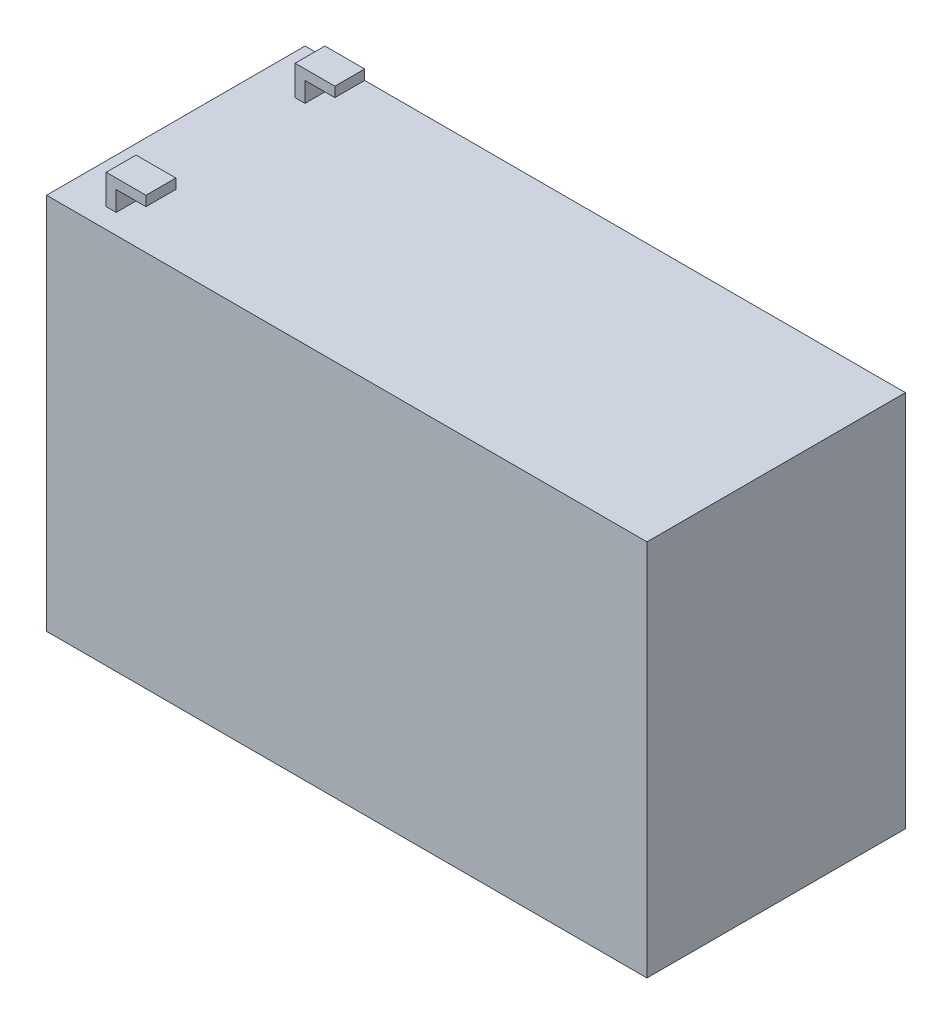
ISO-10303-21;
HEADER;
FILE_DESCRIPTION(('STEP AP214'),'2;1');
FILE_NAME('part.step','',(''),(''),'','','');
FILE_SCHEMA(('AUTOMOTIVE_DESIGN { 1 0 10303 214 1 1 1 1 }'));
ENDSEC;
DATA;
#1=APPLICATION_CONTEXT('core data for automotive mechanical design processes');
#2=APPLICATION_PROTOCOL_DEFINITION('international standard','automotive_design',2000,#1);
#3=PRODUCT_CONTEXT('',#1,'mechanical');
#4=PRODUCT('Part','Part','',(#3));
#5=PRODUCT_RELATED_PRODUCT_CATEGORY('part','',(#4));
#6=PRODUCT_DEFINITION_FORMATION('','',#4);
#7=PRODUCT_DEFINITION_CONTEXT('part definition',#1,'design');
#8=PRODUCT_DEFINITION('design','',#6,#7);
#9=PRODUCT_DEFINITION_SHAPE('','',#8);
#10=(LENGTH_UNIT() NAMED_UNIT(*) SI_UNIT(.MILLI.,.METRE.));
#11=(NAMED_UNIT(*) PLANE_ANGLE_UNIT() SI_UNIT($,.RADIAN.));
#12=(NAMED_UNIT(*) SI_UNIT($,.STERADIAN.) SOLID_ANGLE_UNIT());
#13=UNCERTAINTY_MEASURE_WITH_UNIT(LENGTH_MEASURE(1.E-05),#10,'distance_accuracy_value','');
#14=(GEOMETRIC_REPRESENTATION_CONTEXT(3) GLOBAL_UNCERTAINTY_ASSIGNED_CONTEXT((#13)) GLOBAL_UNIT_ASSIGNED_CONTEXT((#10,
#11,#12)) REPRESENTATION_CONTEXT('',''));
#15=CARTESIAN_POINT('',(0.,0.,0.));
#16=DIRECTION('',(0.,0.,1.));
#17=DIRECTION('',(1.,0.,0.));
#18=AXIS2_PLACEMENT_3D('',#15,#16,#17);
#19=CARTESIAN_POINT('',(-65.5,47.5,-65.));
#20=DIRECTION('',(-1.,0.,0.));
#21=DIRECTION('',(0.,0.,1.));
#22=AXIS2_PLACEMENT_3D('',#19,#20,#21);
#23=PLANE('',#22);
#24=DIRECTION('',(0.,1.,0.));
#25=VECTOR('',#24,1.);
#26=CARTESIAN_POINT('',(-65.5,47.5,-60.));
#27=LINE('',#26,#25);
#28=CARTESIAN_POINT('',(-65.5,47.5,-60.));
#29=VERTEX_POINT('',#28);
#30=CARTESIAN_POINT('',(-65.5,55.,-60.));
#31=VERTEX_POINT('',#30);
#32=EDGE_CURVE('E159',#29,#31,#27,.T.);
#33=ORIENTED_EDGE('',*,*,#32,.F.);
#34=DIRECTION('',(0.,0.,1.));
#35=VECTOR('',#34,1.);
#36=CARTESIAN_POINT('',(-65.5,47.5,-65.));
#37=LINE('',#36,#35);
#38=CARTESIAN_POINT('',(-65.5,47.5,-52.5));
#39=VERTEX_POINT('',#38);
#40=EDGE_CURVE('E214',#29,#39,#37,.T.);
#41=ORIENTED_EDGE('',*,*,#40,.T.);
#42=DIRECTION('',(0.,-1.,0.));
#43=VECTOR('',#42,1.);
#44=CARTESIAN_POINT('',(-65.5,55.,-52.5));
#45=LINE('',#44,#43);
#46=CARTESIAN_POINT('',(-65.5,55.,-52.5));
#47=VERTEX_POINT('',#46);
#48=EDGE_CURVE('E277',#47,#39,#45,.T.);
#49=ORIENTED_EDGE('',*,*,#48,.F.);
#50=DIRECTION('',(0.,0.,1.));
#51=VECTOR('',#50,1.);
#52=CARTESIAN_POINT('',(-65.5,55.,-65.));
#53=LINE('',#52,#51);
#54=EDGE_CURVE('E183',#31,#47,#53,.T.);
#55=ORIENTED_EDGE('',*,*,#54,.F.);
#56=EDGE_LOOP('',(#33,#41,#49,#55));
#57=FACE_BOUND('',#56,.T.);
#58=ADVANCED_FACE('F37',(#57),#23,.T.);
#59=CARTESIAN_POINT('',(-65.5,55.,-65.));
#60=DIRECTION('',(0.,1.,0.));
#61=DIRECTION('',(0.,0.,1.));
#62=AXIS2_PLACEMENT_3D('',#59,#60,#61);
#63=PLANE('',#62);
#64=DIRECTION('',(-1.,0.,0.));
#65=VECTOR('',#64,1.);
#66=CARTESIAN_POINT('',(75.501,55.,-60.));
#67=LINE('',#66,#65);
#68=CARTESIAN_POINT('',(-55.5,55.,-60.));
#69=VERTEX_POINT('',#68);
#70=EDGE_CURVE('E153',#69,#31,#67,.T.);
#71=ORIENTED_EDGE('',*,*,#70,.T.);
#72=ORIENTED_EDGE('',*,*,#54,.T.);
#73=DIRECTION('',(-1.,0.,0.));
#74=VECTOR('',#73,1.);
#75=CARTESIAN_POINT('',(75.501,55.,-52.5));
#76=LINE('',#75,#74);
#77=CARTESIAN_POINT('',(-55.5,55.,-52.5));
#78=VERTEX_POINT('',#77);
#79=EDGE_CURVE('E178',#78,#47,#76,.T.);
#80=ORIENTED_EDGE('',*,*,#79,.F.);
#81=DIRECTION('',(0.,0.,1.));
#82=VECTOR('',#81,1.);
#83=CARTESIAN_POINT('',(-55.5,55.,-65.));
#84=LINE('',#83,#82);
#85=EDGE_CURVE('E170',#69,#78,#84,.T.);
#86=ORIENTED_EDGE('',*,*,#85,.F.);
#87=EDGE_LOOP('',(#71,#72,#80,#86));
#88=FACE_BOUND('',#87,.T.);
#89=ADVANCED_FACE('F177',(#88),#63,.T.);
#90=CARTESIAN_POINT('',(-55.5,55.,-65.));
#91=DIRECTION('',(1.,0.,0.));
#92=DIRECTION('',(0.,0.,-1.));
#93=AXIS2_PLACEMENT_3D('',#90,#91,#92);
#94=PLANE('',#93);
#95=DIRECTION('',(0.,1.,0.));
#96=VECTOR('',#95,1.);
#97=CARTESIAN_POINT('',(-55.5,47.5,-60.));
#98=LINE('',#97,#96);
#99=CARTESIAN_POINT('',(-55.5,52.5,-60.));
#100=VERTEX_POINT('',#99);
#101=EDGE_CURVE('E156',#100,#69,#98,.T.);
#102=ORIENTED_EDGE('',*,*,#101,.T.);
#103=ORIENTED_EDGE('',*,*,#85,.T.);
#104=DIRECTION('',(0.,-1.,0.));
#105=VECTOR('',#104,1.);
#106=CARTESIAN_POINT('',(-55.5,55.,-52.5));
#107=LINE('',#106,#105);
#108=CARTESIAN_POINT('',(-55.5,52.5,-52.5));
#109=VERTEX_POINT('',#108);
#110=EDGE_CURVE('E310',#78,#109,#107,.T.);
#111=ORIENTED_EDGE('',*,*,#110,.T.);
#112=DIRECTION('',(0.,0.,1.));
#113=VECTOR('',#112,1.);
#114=CARTESIAN_POINT('',(-55.5,52.5,-65.));
#115=LINE('',#114,#113);
#116=EDGE_CURVE('E172',#100,#109,#115,.T.);
#117=ORIENTED_EDGE('',*,*,#116,.F.);
#118=EDGE_LOOP('',(#102,#103,#111,#117));
#119=FACE_BOUND('',#118,.T.);
#120=ADVANCED_FACE('F168',(#119),#94,.T.);
#121=CARTESIAN_POINT('',(-55.5,52.5,-65.));
#122=DIRECTION('',(0.,-1.,0.));
#123=DIRECTION('',(0.,0.,-1.));
#124=AXIS2_PLACEMENT_3D('',#121,#122,#123);
#125=PLANE('',#124);
#126=DIRECTION('',(1.,0.,0.));
#127=VECTOR('',#126,1.);
#128=CARTESIAN_POINT('',(75.501,52.5,-60.));
#129=LINE('',#128,#127);
#130=CARTESIAN_POINT('',(-63.,52.5,-60.));
#131=VERTEX_POINT('',#130);
#132=EDGE_CURVE('E322',#131,#100,#129,.T.);
#133=ORIENTED_EDGE('',*,*,#132,.T.);
#134=ORIENTED_EDGE('',*,*,#116,.T.);
#135=DIRECTION('',(-1.,0.,0.));
#136=VECTOR('',#135,1.);
#137=CARTESIAN_POINT('',(75.501,52.5,-52.5));
#138=LINE('',#137,#136);
#139=CARTESIAN_POINT('',(-63.,52.5,-52.5));
#140=VERTEX_POINT('',#139);
#141=EDGE_CURVE('E312',#109,#140,#138,.T.);
#142=ORIENTED_EDGE('',*,*,#141,.T.);
#143=DIRECTION('',(0.,0.,1.));
#144=VECTOR('',#143,1.);
#145=CARTESIAN_POINT('',(-63.,52.5,-65.));
#146=LINE('',#145,#144);
#147=EDGE_CURVE('E191',#131,#140,#146,.T.);
#148=ORIENTED_EDGE('',*,*,#147,.F.);
#149=EDGE_LOOP('',(#133,#134,#142,#148));
#150=FACE_BOUND('',#149,.T.);
#151=ADVANCED_FACE('F331',(#150),#125,.T.);
#152=CARTESIAN_POINT('',(-63.,52.5,-65.));
#153=DIRECTION('',(1.,0.,0.));
#154=DIRECTION('',(0.,0.,-1.));
#155=AXIS2_PLACEMENT_3D('',#152,#153,#154);
#156=PLANE('',#155);
#157=DIRECTION('',(0.,1.,0.));
#158=VECTOR('',#157,1.);
#159=CARTESIAN_POINT('',(-63.,47.5,-60.));
#160=LINE('',#159,#158);
#161=CARTESIAN_POINT('',(-63.,47.5,-60.));
#162=VERTEX_POINT('',#161);
#163=EDGE_CURVE('E173',#162,#131,#160,.T.);
#164=ORIENTED_EDGE('',*,*,#163,.T.);
#165=ORIENTED_EDGE('',*,*,#147,.T.);
#166=DIRECTION('',(0.,-1.,0.));
#167=VECTOR('',#166,1.);
#168=CARTESIAN_POINT('',(-63.,55.,-52.5));
#169=LINE('',#168,#167);
#170=CARTESIAN_POINT('',(-63.,47.5,-52.5));
#171=VERTEX_POINT('',#170);
#172=EDGE_CURVE('E315',#140,#171,#169,.T.);
#173=ORIENTED_EDGE('',*,*,#172,.T.);
#174=DIRECTION('',(0.,0.,1.));
#175=VECTOR('',#174,1.);
#176=CARTESIAN_POINT('',(-63.,47.5,-65.));
#177=LINE('',#176,#175);
#178=EDGE_CURVE('E195',#162,#171,#177,.T.);
#179=ORIENTED_EDGE('',*,*,#178,.F.);
#180=EDGE_LOOP('',(#164,#165,#173,#179));
#181=FACE_BOUND('',#180,.T.);
#182=ADVANCED_FACE('F329',(#181),#156,.T.);
#183=CARTESIAN_POINT('',(-75.5,47.5,-65.));
#184=DIRECTION('',(-1.,0.,0.));
#185=DIRECTION('',(0.,0.,1.));
#186=AXIS2_PLACEMENT_3D('',#183,#184,#185);
#187=PLANE('',#186);
#188=DIRECTION('',(0.,-1.,0.));
#189=VECTOR('',#188,1.);
#190=CARTESIAN_POINT('',(-75.5,47.5,0.));
#191=LINE('',#190,#189);
#192=CARTESIAN_POINT('',(-75.5,47.5,0.));
#193=VERTEX_POINT('',#192);
#194=CARTESIAN_POINT('',(-75.5,-47.5,0.));
#195=VERTEX_POINT('',#194);
#196=EDGE_CURVE('E210',#193,#195,#191,.T.);
#197=ORIENTED_EDGE('',*,*,#196,.F.);
#198=DIRECTION('',(0.,0.,1.));
#199=VECTOR('',#198,1.);
#200=CARTESIAN_POINT('',(-75.5,47.5,-65.));
#201=LINE('',#200,#199);
#202=CARTESIAN_POINT('',(-75.5,47.5,-65.));
#203=VERTEX_POINT('',#202);
#204=EDGE_CURVE('E11',#203,#193,#201,.T.);
#205=ORIENTED_EDGE('',*,*,#204,.F.);
#206=DIRECTION('',(0.,-1.,0.));
#207=VECTOR('',#206,1.);
#208=CARTESIAN_POINT('',(-75.5,47.5,-65.));
#209=LINE('',#208,#207);
#210=CARTESIAN_POINT('',(-75.5,-47.5,-65.));
#211=VERTEX_POINT('',#210);
#212=EDGE_CURVE('E198',#203,#211,#209,.T.);
#213=ORIENTED_EDGE('',*,*,#212,.T.);
#214=DIRECTION('',(0.,0.,1.));
#215=VECTOR('',#214,1.);
#216=CARTESIAN_POINT('',(-75.5,-47.5,-65.));
#217=LINE('',#216,#215);
#218=EDGE_CURVE('E41',#211,#195,#217,.T.);
#219=ORIENTED_EDGE('',*,*,#218,.T.);
#220=EDGE_LOOP('',(#197,#205,#213,#219));
#221=FACE_BOUND('',#220,.T.);
#222=ADVANCED_FACE('F39',(#221),#187,.T.);
#223=CARTESIAN_POINT('',(-75.5,47.5,-65.));
#224=DIRECTION('',(0.,1.,0.));
#225=DIRECTION('',(0.,0.,1.));
#226=AXIS2_PLACEMENT_3D('',#223,#224,#225);
#227=PLANE('',#226);
#228=ORIENTED_EDGE('',*,*,#40,.F.);
#229=DIRECTION('',(-1.,0.,0.));
#230=VECTOR('',#229,1.);
#231=CARTESIAN_POINT('',(75.501,47.5,-60.));
#232=LINE('',#231,#230);
#233=EDGE_CURVE('E62',#162,#29,#232,.T.);
#234=ORIENTED_EDGE('',*,*,#233,.F.);
#235=ORIENTED_EDGE('',*,*,#178,.T.);
#236=DIRECTION('',(-1.,0.,0.));
#237=VECTOR('',#236,1.);
#238=CARTESIAN_POINT('',(75.501,47.5,-52.5));
#239=LINE('',#238,#237);
#240=EDGE_CURVE('E276',#171,#39,#239,.T.);
#241=ORIENTED_EDGE('',*,*,#240,.T.);
#242=EDGE_LOOP('',(#228,#234,#235,#241));
#243=FACE_BOUND('',#242,.T.);
#244=CARTESIAN_POINT('',(-65.5,47.5,-12.5));
#245=VERTEX_POINT('',#244);
#246=CARTESIAN_POINT('',(-65.5,47.5,-5.));
#247=VERTEX_POINT('',#246);
#248=EDGE_CURVE('E273',#245,#247,#37,.T.);
#249=ORIENTED_EDGE('',*,*,#248,.F.);
#250=DIRECTION('',(-1.,0.,0.));
#251=VECTOR('',#250,1.);
#252=CARTESIAN_POINT('',(75.501,47.5,-12.5));
#253=LINE('',#252,#251);
#254=CARTESIAN_POINT('',(-63.,47.5,-12.5));
#255=VERTEX_POINT('',#254);
#256=EDGE_CURVE('E54',#255,#245,#253,.T.);
#257=ORIENTED_EDGE('',*,*,#256,.F.);
#258=CARTESIAN_POINT('',(-63.,47.5,-5.));
#259=VERTEX_POINT('',#258);
#260=EDGE_CURVE('E196',#255,#259,#177,.T.);
#261=ORIENTED_EDGE('',*,*,#260,.T.);
#262=DIRECTION('',(-1.,0.,0.));
#263=VECTOR('',#262,1.);
#264=CARTESIAN_POINT('',(75.501,47.5,-5.));
#265=LINE('',#264,#263);
#266=EDGE_CURVE('E279',#259,#247,#265,.T.);
#267=ORIENTED_EDGE('',*,*,#266,.T.);
#268=EDGE_LOOP('',(#249,#257,#261,#267));
#269=FACE_BOUND('',#268,.T.);
#270=DIRECTION('',(-1.,0.,0.));
#271=VECTOR('',#270,1.);
#272=CARTESIAN_POINT('',(-75.5,47.5,-65.));
#273=LINE('',#272,#271);
#274=CARTESIAN_POINT('',(75.5,47.5,-65.));
#275=VERTEX_POINT('',#274);
#276=EDGE_CURVE('E208',#275,#203,#273,.T.);
#277=ORIENTED_EDGE('',*,*,#276,.T.);
#278=ORIENTED_EDGE('',*,*,#204,.T.);
#279=DIRECTION('',(-1.,0.,0.));
#280=VECTOR('',#279,1.);
#281=CARTESIAN_POINT('',(-75.5,47.5,0.));
#282=LINE('',#281,#280);
#283=CARTESIAN_POINT('',(75.5,47.5,0.));
#284=VERTEX_POINT('',#283);
#285=EDGE_CURVE('E202',#284,#193,#282,.T.);
#286=ORIENTED_EDGE('',*,*,#285,.F.);
#287=DIRECTION('',(0.,0.,1.));
#288=VECTOR('',#287,1.);
#289=CARTESIAN_POINT('',(75.5,47.5,-65.));
#290=LINE('',#289,#288);
#291=EDGE_CURVE('E46',#275,#284,#290,.T.);
#292=ORIENTED_EDGE('',*,*,#291,.F.);
#293=EDGE_LOOP('',(#277,#278,#286,#292));
#294=FACE_BOUND('',#293,.T.);
#295=ADVANCED_FACE('F235',(#243,#269,#294),#227,.T.);
#296=CARTESIAN_POINT('',(75.5,47.5,-65.));
#297=DIRECTION('',(1.,0.,0.));
#298=DIRECTION('',(0.,0.,-1.));
#299=AXIS2_PLACEMENT_3D('',#296,#297,#298);
#300=PLANE('',#299);
#301=DIRECTION('',(0.,1.,0.));
#302=VECTOR('',#301,1.);
#303=CARTESIAN_POINT('',(75.5,47.5,0.));
#304=LINE('',#303,#302);
#305=CARTESIAN_POINT('',(75.5,-47.5,0.));
#306=VERTEX_POINT('',#305);
#307=EDGE_CURVE('E217',#306,#284,#304,.T.);
#308=ORIENTED_EDGE('',*,*,#307,.F.);
#309=DIRECTION('',(0.,0.,1.));
#310=VECTOR('',#309,1.);
#311=CARTESIAN_POINT('',(75.5,-47.5,-65.));
#312=LINE('',#311,#310);
#313=CARTESIAN_POINT('',(75.5,-47.5,-65.));
#314=VERTEX_POINT('',#313);
#315=EDGE_CURVE('E221',#314,#306,#312,.T.);
#316=ORIENTED_EDGE('',*,*,#315,.F.);
#317=DIRECTION('',(0.,1.,0.));
#318=VECTOR('',#317,1.);
#319=CARTESIAN_POINT('',(75.5,47.5,-65.));
#320=LINE('',#319,#318);
#321=EDGE_CURVE('E205',#314,#275,#320,.T.);
#322=ORIENTED_EDGE('',*,*,#321,.T.);
#323=ORIENTED_EDGE('',*,*,#291,.T.);
#324=EDGE_LOOP('',(#308,#316,#322,#323));
#325=FACE_BOUND('',#324,.T.);
#326=ADVANCED_FACE('F241',(#325),#300,.T.);
#327=CARTESIAN_POINT('',(-75.5,-47.5,-65.));
#328=DIRECTION('',(0.,-1.,0.));
#329=DIRECTION('',(0.,0.,-1.));
#330=AXIS2_PLACEMENT_3D('',#327,#328,#329);
#331=PLANE('',#330);
#332=DIRECTION('',(1.,0.,0.));
#333=VECTOR('',#332,1.);
#334=CARTESIAN_POINT('',(-75.5,-47.5,0.));
#335=LINE('',#334,#333);
#336=EDGE_CURVE('E213',#195,#306,#335,.T.);
#337=ORIENTED_EDGE('',*,*,#336,.F.);
#338=ORIENTED_EDGE('',*,*,#218,.F.);
#339=DIRECTION('',(1.,0.,0.));
#340=VECTOR('',#339,1.);
#341=CARTESIAN_POINT('',(-75.5,-47.5,-65.));
#342=LINE('',#341,#340);
#343=EDGE_CURVE('E201',#211,#314,#342,.T.);
#344=ORIENTED_EDGE('',*,*,#343,.T.);
#345=ORIENTED_EDGE('',*,*,#315,.T.);
#346=EDGE_LOOP('',(#337,#338,#344,#345));
#347=FACE_BOUND('',#346,.T.);
#348=ADVANCED_FACE('F230',(#347),#331,.T.);
#349=CARTESIAN_POINT('',(0.,0.,-65.));
#350=DIRECTION('',(0.,0.,1.));
#351=DIRECTION('',(1.,0.,0.));
#352=AXIS2_PLACEMENT_3D('',#349,#350,#351);
#353=PLANE('',#352);
#354=ORIENTED_EDGE('',*,*,#212,.F.);
#355=ORIENTED_EDGE('',*,*,#276,.F.);
#356=ORIENTED_EDGE('',*,*,#321,.F.);
#357=ORIENTED_EDGE('',*,*,#343,.F.);
#358=EDGE_LOOP('',(#354,#355,#356,#357));
#359=FACE_BOUND('',#358,.T.);
#360=ADVANCED_FACE('F238',(#359),#353,.F.);
#361=CARTESIAN_POINT('',(0.,0.,0.));
#362=DIRECTION('',(0.,0.,1.));
#363=DIRECTION('',(1.,0.,0.));
#364=AXIS2_PLACEMENT_3D('',#361,#362,#363);
#365=PLANE('',#364);
#366=ORIENTED_EDGE('',*,*,#285,.T.);
#367=ORIENTED_EDGE('',*,*,#196,.T.);
#368=ORIENTED_EDGE('',*,*,#336,.T.);
#369=ORIENTED_EDGE('',*,*,#307,.T.);
#370=EDGE_LOOP('',(#366,#367,#368,#369));
#371=FACE_BOUND('',#370,.T.);
#372=ADVANCED_FACE('F232',(#371),#365,.T.);
#373=DIRECTION('',(0.,1.,0.));
#374=VECTOR('',#373,1.);
#375=CARTESIAN_POINT('',(-65.5,55.,-12.5));
#376=LINE('',#375,#374);
#377=CARTESIAN_POINT('',(-65.5,55.,-12.5));
#378=VERTEX_POINT('',#377);
#379=EDGE_CURVE('E271',#245,#378,#376,.T.);
#380=ORIENTED_EDGE('',*,*,#379,.F.);
#381=ORIENTED_EDGE('',*,*,#248,.T.);
#382=DIRECTION('',(0.,-1.,0.));
#383=VECTOR('',#382,1.);
#384=CARTESIAN_POINT('',(-65.5,55.,-5.));
#385=LINE('',#384,#383);
#386=CARTESIAN_POINT('',(-65.5,55.,-5.));
#387=VERTEX_POINT('',#386);
#388=EDGE_CURVE('E285',#387,#247,#385,.T.);
#389=ORIENTED_EDGE('',*,*,#388,.F.);
#390=EDGE_CURVE('E179',#378,#387,#53,.T.);
#391=ORIENTED_EDGE('',*,*,#390,.F.);
#392=EDGE_LOOP('',(#380,#381,#389,#391));
#393=FACE_BOUND('',#392,.T.);
#394=ADVANCED_FACE('F252',(#393),#23,.T.);
#395=DIRECTION('',(-1.,0.,0.));
#396=VECTOR('',#395,1.);
#397=CARTESIAN_POINT('',(75.501,55.,-12.5));
#398=LINE('',#397,#396);
#399=CARTESIAN_POINT('',(-55.5,55.,-12.5));
#400=VERTEX_POINT('',#399);
#401=EDGE_CURVE('E305',#400,#378,#398,.T.);
#402=ORIENTED_EDGE('',*,*,#401,.T.);
#403=ORIENTED_EDGE('',*,*,#390,.T.);
#404=DIRECTION('',(-1.,0.,0.));
#405=VECTOR('',#404,1.);
#406=CARTESIAN_POINT('',(75.501,55.,-5.));
#407=LINE('',#406,#405);
#408=CARTESIAN_POINT('',(-55.5,55.,-5.));
#409=VERTEX_POINT('',#408);
#410=EDGE_CURVE('E284',#409,#387,#407,.T.);
#411=ORIENTED_EDGE('',*,*,#410,.F.);
#412=EDGE_CURVE('E180',#400,#409,#84,.T.);
#413=ORIENTED_EDGE('',*,*,#412,.F.);
#414=EDGE_LOOP('',(#402,#403,#411,#413));
#415=FACE_BOUND('',#414,.T.);
#416=ADVANCED_FACE('F257',(#415),#63,.T.);
#417=DIRECTION('',(0.,1.,0.));
#418=VECTOR('',#417,1.);
#419=CARTESIAN_POINT('',(-55.5,55.,-12.5));
#420=LINE('',#419,#418);
#421=CARTESIAN_POINT('',(-55.5,52.5,-12.5));
#422=VERTEX_POINT('',#421);
#423=EDGE_CURVE('E174',#422,#400,#420,.T.);
#424=ORIENTED_EDGE('',*,*,#423,.T.);
#425=ORIENTED_EDGE('',*,*,#412,.T.);
#426=DIRECTION('',(0.,-1.,0.));
#427=VECTOR('',#426,1.);
#428=CARTESIAN_POINT('',(-55.5,55.,-5.));
#429=LINE('',#428,#427);
#430=CARTESIAN_POINT('',(-55.5,52.5,-5.));
#431=VERTEX_POINT('',#430);
#432=EDGE_CURVE('E289',#409,#431,#429,.T.);
#433=ORIENTED_EDGE('',*,*,#432,.T.);
#434=EDGE_CURVE('E188',#422,#431,#115,.T.);
#435=ORIENTED_EDGE('',*,*,#434,.F.);
#436=EDGE_LOOP('',(#424,#425,#433,#435));
#437=FACE_BOUND('',#436,.T.);
#438=ADVANCED_FACE('F265',(#437),#94,.T.);
#439=DIRECTION('',(1.,0.,0.));
#440=VECTOR('',#439,1.);
#441=CARTESIAN_POINT('',(75.501,52.5,-12.5));
#442=LINE('',#441,#440);
#443=CARTESIAN_POINT('',(-63.,52.5,-12.5));
#444=VERTEX_POINT('',#443);
#445=EDGE_CURVE('E300',#444,#422,#442,.T.);
#446=ORIENTED_EDGE('',*,*,#445,.T.);
#447=ORIENTED_EDGE('',*,*,#434,.T.);
#448=DIRECTION('',(-1.,0.,0.));
#449=VECTOR('',#448,1.);
#450=CARTESIAN_POINT('',(75.501,52.5,-5.));
#451=LINE('',#450,#449);
#452=CARTESIAN_POINT('',(-63.,52.5,-5.));
#453=VERTEX_POINT('',#452);
#454=EDGE_CURVE('E292',#431,#453,#451,.T.);
#455=ORIENTED_EDGE('',*,*,#454,.T.);
#456=EDGE_CURVE('E192',#444,#453,#146,.T.);
#457=ORIENTED_EDGE('',*,*,#456,.F.);
#458=EDGE_LOOP('',(#446,#447,#455,#457));
#459=FACE_BOUND('',#458,.T.);
#460=ADVANCED_FACE('F374',(#459),#125,.T.);
#461=DIRECTION('',(0.,1.,0.));
#462=VECTOR('',#461,1.);
#463=CARTESIAN_POINT('',(-63.,55.,-12.5));
#464=LINE('',#463,#462);
#465=EDGE_CURVE('E287',#255,#444,#464,.T.);
#466=ORIENTED_EDGE('',*,*,#465,.T.);
#467=ORIENTED_EDGE('',*,*,#456,.T.);
#468=DIRECTION('',(0.,-1.,0.));
#469=VECTOR('',#468,1.);
#470=CARTESIAN_POINT('',(-63.,55.,-5.));
#471=LINE('',#470,#469);
#472=EDGE_CURVE('E295',#453,#259,#471,.T.);
#473=ORIENTED_EDGE('',*,*,#472,.T.);
#474=ORIENTED_EDGE('',*,*,#260,.F.);
#475=EDGE_LOOP('',(#466,#467,#473,#474));
#476=FACE_BOUND('',#475,.T.);
#477=ADVANCED_FACE('F344',(#476),#156,.T.);
#478=CARTESIAN_POINT('',(75.501,55.,-5.));
#479=DIRECTION('',(0.,0.,-1.));
#480=DIRECTION('',(0.,1.,0.));
#481=AXIS2_PLACEMENT_3D('',#478,#479,#480);
#482=PLANE('',#481);
#483=ORIENTED_EDGE('',*,*,#410,.T.);
#484=ORIENTED_EDGE('',*,*,#388,.T.);
#485=ORIENTED_EDGE('',*,*,#266,.F.);
#486=ORIENTED_EDGE('',*,*,#472,.F.);
#487=ORIENTED_EDGE('',*,*,#454,.F.);
#488=ORIENTED_EDGE('',*,*,#432,.F.);
#489=EDGE_LOOP('',(#483,#484,#485,#486,#487,#488));
#490=FACE_BOUND('',#489,.T.);
#491=ADVANCED_FACE('F337',(#490),#482,.F.);
#492=CARTESIAN_POINT('',(75.501,55.,-52.5));
#493=DIRECTION('',(0.,0.,-1.));
#494=DIRECTION('',(-1.,0.,0.));
#495=AXIS2_PLACEMENT_3D('',#492,#493,#494);
#496=PLANE('',#495);
#497=ORIENTED_EDGE('',*,*,#79,.T.);
#498=ORIENTED_EDGE('',*,*,#48,.T.);
#499=ORIENTED_EDGE('',*,*,#240,.F.);
#500=ORIENTED_EDGE('',*,*,#172,.F.);
#501=ORIENTED_EDGE('',*,*,#141,.F.);
#502=ORIENTED_EDGE('',*,*,#110,.F.);
#503=EDGE_LOOP('',(#497,#498,#499,#500,#501,#502));
#504=FACE_BOUND('',#503,.T.);
#505=ADVANCED_FACE('F333',(#504),#496,.F.);
#506=CARTESIAN_POINT('',(75.501,55.,-12.5));
#507=DIRECTION('',(0.,0.,1.));
#508=DIRECTION('',(1.,0.,0.));
#509=AXIS2_PLACEMENT_3D('',#506,#507,#508);
#510=PLANE('',#509);
#511=ORIENTED_EDGE('',*,*,#445,.F.);
#512=ORIENTED_EDGE('',*,*,#465,.F.);
#513=ORIENTED_EDGE('',*,*,#256,.T.);
#514=ORIENTED_EDGE('',*,*,#379,.T.);
#515=ORIENTED_EDGE('',*,*,#401,.F.);
#516=ORIENTED_EDGE('',*,*,#423,.F.);
#517=EDGE_LOOP('',(#511,#512,#513,#514,#515,#516));
#518=FACE_BOUND('',#517,.T.);
#519=ADVANCED_FACE('F336',(#518),#510,.F.);
#520=CARTESIAN_POINT('',(75.501,47.5,-60.));
#521=DIRECTION('',(0.,0.,1.));
#522=DIRECTION('',(1.,0.,0.));
#523=AXIS2_PLACEMENT_3D('',#520,#521,#522);
#524=PLANE('',#523);
#525=ORIENTED_EDGE('',*,*,#132,.F.);
#526=ORIENTED_EDGE('',*,*,#163,.F.);
#527=ORIENTED_EDGE('',*,*,#233,.T.);
#528=ORIENTED_EDGE('',*,*,#32,.T.);
#529=ORIENTED_EDGE('',*,*,#70,.F.);
#530=ORIENTED_EDGE('',*,*,#101,.F.);
#531=EDGE_LOOP('',(#525,#526,#527,#528,#529,#530));
#532=FACE_BOUND('',#531,.T.);
#533=ADVANCED_FACE('F155',(#532),#524,.F.);
#534=CLOSED_SHELL('',(#58,#89,#120,#151,#182,#222,#295,#326,#348,#360,#372,#394,#416,#438,#460,
#477,#491,#505,#519,#533));
#535=MANIFOLD_SOLID_BREP('B2',#534);
#536=ADVANCED_BREP_SHAPE_REPRESENTATION('',(#18,#535),#14);
#537=SHAPE_DEFINITION_REPRESENTATION(#9,#536);
ENDSEC;
END-ISO-10303-21;
